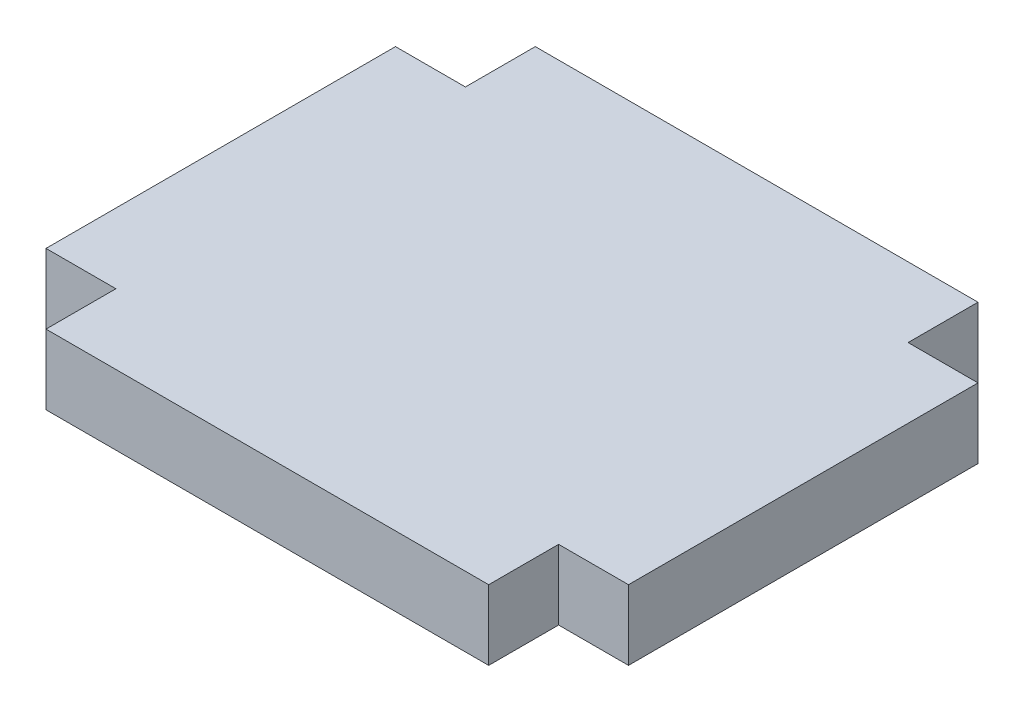
ISO-10303-21;
HEADER;
FILE_DESCRIPTION(('STEP AP214'),'2;1');
FILE_NAME('part.step','',(''),(''),'','','');
FILE_SCHEMA(('AUTOMOTIVE_DESIGN { 1 0 10303 214 1 1 1 1 }'));
ENDSEC;
DATA;
#1=APPLICATION_CONTEXT('core data for automotive mechanical design processes');
#2=APPLICATION_PROTOCOL_DEFINITION('international standard','automotive_design',2000,#1);
#3=PRODUCT_CONTEXT('',#1,'mechanical');
#4=PRODUCT('Part','Part','',(#3));
#5=PRODUCT_RELATED_PRODUCT_CATEGORY('part','',(#4));
#6=PRODUCT_DEFINITION_FORMATION('','',#4);
#7=PRODUCT_DEFINITION_CONTEXT('part definition',#1,'design');
#8=PRODUCT_DEFINITION('design','',#6,#7);
#9=PRODUCT_DEFINITION_SHAPE('','',#8);
#10=(LENGTH_UNIT() NAMED_UNIT(*) SI_UNIT(.MILLI.,.METRE.));
#11=(NAMED_UNIT(*) PLANE_ANGLE_UNIT() SI_UNIT($,.RADIAN.));
#12=(NAMED_UNIT(*) SI_UNIT($,.STERADIAN.) SOLID_ANGLE_UNIT());
#13=UNCERTAINTY_MEASURE_WITH_UNIT(LENGTH_MEASURE(1.E-05),#10,'distance_accuracy_value','');
#14=(GEOMETRIC_REPRESENTATION_CONTEXT(3) GLOBAL_UNCERTAINTY_ASSIGNED_CONTEXT((#13)) GLOBAL_UNIT_ASSIGNED_CONTEXT((#10,
#11,#12)) REPRESENTATION_CONTEXT('',''));
#15=CARTESIAN_POINT('',(0.,0.,0.));
#16=DIRECTION('',(0.,0.,1.));
#17=DIRECTION('',(1.,0.,0.));
#18=AXIS2_PLACEMENT_3D('',#15,#16,#17);
#19=CARTESIAN_POINT('',(-9.5,1.5,-7.50000000000001));
#20=DIRECTION('',(1.,0.,0.));
#21=DIRECTION('',(0.,0.,-1.));
#22=AXIS2_PLACEMENT_3D('',#19,#20,#21);
#23=PLANE('',#22);
#24=DIRECTION('',(0.,0.,1.));
#25=VECTOR('',#24,1.);
#26=CARTESIAN_POINT('',(-9.5,-1.5,-7.50000000000001));
#27=LINE('',#26,#25);
#28=CARTESIAN_POINT('',(-9.5,-1.5,-10.5));
#29=VERTEX_POINT('',#28);
#30=CARTESIAN_POINT('',(-9.5,-1.5,-7.50000000000001));
#31=VERTEX_POINT('',#30);
#32=EDGE_CURVE('E159',#29,#31,#27,.T.);
#33=ORIENTED_EDGE('',*,*,#32,.T.);
#34=DIRECTION('',(0.,-1.,0.));
#35=VECTOR('',#34,1.);
#36=CARTESIAN_POINT('',(-9.5,1.5,-7.50000000000001));
#37=LINE('',#36,#35);
#38=CARTESIAN_POINT('',(-9.5,1.5,-7.50000000000001));
#39=VERTEX_POINT('',#38);
#40=EDGE_CURVE('E11',#39,#31,#37,.T.);
#41=ORIENTED_EDGE('',*,*,#40,.F.);
#42=DIRECTION('',(0.,0.,1.));
#43=VECTOR('',#42,1.);
#44=CARTESIAN_POINT('',(-9.5,1.5,-7.50000000000001));
#45=LINE('',#44,#43);
#46=CARTESIAN_POINT('',(-9.5,1.5,-10.5));
#47=VERTEX_POINT('',#46);
#48=EDGE_CURVE('E181',#47,#39,#45,.T.);
#49=ORIENTED_EDGE('',*,*,#48,.F.);
#50=DIRECTION('',(0.,-1.,0.));
#51=VECTOR('',#50,1.);
#52=CARTESIAN_POINT('',(-9.5,1.5,-10.5));
#53=LINE('',#52,#51);
#54=EDGE_CURVE('E155',#47,#29,#53,.T.);
#55=ORIENTED_EDGE('',*,*,#54,.T.);
#56=EDGE_LOOP('',(#33,#41,#49,#55));
#57=FACE_BOUND('',#56,.T.);
#58=ADVANCED_FACE('F39',(#57),#23,.F.);
#59=CARTESIAN_POINT('',(-12.5,1.5,-7.5));
#60=DIRECTION('',(0.,0.,1.));
#61=DIRECTION('',(1.,0.,0.));
#62=AXIS2_PLACEMENT_3D('',#59,#60,#61);
#63=PLANE('',#62);
#64=DIRECTION('',(-1.,0.,0.));
#65=VECTOR('',#64,1.);
#66=CARTESIAN_POINT('',(-12.5,-1.5,-7.5));
#67=LINE('',#66,#65);
#68=CARTESIAN_POINT('',(-12.5,-1.5,-7.5));
#69=VERTEX_POINT('',#68);
#70=EDGE_CURVE('E162',#31,#69,#67,.T.);
#71=ORIENTED_EDGE('',*,*,#70,.T.);
#72=DIRECTION('',(0.,-1.,0.));
#73=VECTOR('',#72,1.);
#74=CARTESIAN_POINT('',(-12.5,1.5,-7.5));
#75=LINE('',#74,#73);
#76=CARTESIAN_POINT('',(-12.5,1.5,-7.5));
#77=VERTEX_POINT('',#76);
#78=EDGE_CURVE('E47',#77,#69,#75,.T.);
#79=ORIENTED_EDGE('',*,*,#78,.F.);
#80=DIRECTION('',(-1.,0.,0.));
#81=VECTOR('',#80,1.);
#82=CARTESIAN_POINT('',(-12.5,1.5,-7.5));
#83=LINE('',#82,#81);
#84=EDGE_CURVE('E110',#39,#77,#83,.T.);
#85=ORIENTED_EDGE('',*,*,#84,.F.);
#86=ORIENTED_EDGE('',*,*,#40,.T.);
#87=EDGE_LOOP('',(#71,#79,#85,#86));
#88=FACE_BOUND('',#87,.T.);
#89=ADVANCED_FACE('F259',(#88),#63,.F.);
#90=CARTESIAN_POINT('',(-12.5,1.5,7.5));
#91=DIRECTION('',(1.,0.,0.));
#92=DIRECTION('',(0.,0.,-1.));
#93=AXIS2_PLACEMENT_3D('',#90,#91,#92);
#94=PLANE('',#93);
#95=DIRECTION('',(0.,0.,1.));
#96=VECTOR('',#95,1.);
#97=CARTESIAN_POINT('',(-12.5,-1.5,7.5));
#98=LINE('',#97,#96);
#99=CARTESIAN_POINT('',(-12.5,-1.5,7.5));
#100=VERTEX_POINT('',#99);
#101=EDGE_CURVE('E164',#69,#100,#98,.T.);
#102=ORIENTED_EDGE('',*,*,#101,.T.);
#103=DIRECTION('',(0.,-1.,0.));
#104=VECTOR('',#103,1.);
#105=CARTESIAN_POINT('',(-12.5,1.5,7.5));
#106=LINE('',#105,#104);
#107=CARTESIAN_POINT('',(-12.5,1.5,7.5));
#108=VERTEX_POINT('',#107);
#109=EDGE_CURVE('E200',#108,#100,#106,.T.);
#110=ORIENTED_EDGE('',*,*,#109,.F.);
#111=DIRECTION('',(0.,0.,1.));
#112=VECTOR('',#111,1.);
#113=CARTESIAN_POINT('',(-12.5,1.5,7.5));
#114=LINE('',#113,#112);
#115=EDGE_CURVE('E208',#77,#108,#114,.T.);
#116=ORIENTED_EDGE('',*,*,#115,.F.);
#117=ORIENTED_EDGE('',*,*,#78,.T.);
#118=EDGE_LOOP('',(#102,#110,#116,#117));
#119=FACE_BOUND('',#118,.T.);
#120=ADVANCED_FACE('F206',(#119),#94,.F.);
#121=CARTESIAN_POINT('',(-9.5,1.5,7.50000000000001));
#122=DIRECTION('',(0.,0.,-1.));
#123=DIRECTION('',(-1.,0.,0.));
#124=AXIS2_PLACEMENT_3D('',#121,#122,#123);
#125=PLANE('',#124);
#126=DIRECTION('',(1.,0.,0.));
#127=VECTOR('',#126,1.);
#128=CARTESIAN_POINT('',(-9.5,-1.5,7.50000000000001));
#129=LINE('',#128,#127);
#130=CARTESIAN_POINT('',(-9.5,-1.5,7.50000000000001));
#131=VERTEX_POINT('',#130);
#132=EDGE_CURVE('E166',#100,#131,#129,.T.);
#133=ORIENTED_EDGE('',*,*,#132,.T.);
#134=DIRECTION('',(0.,-1.,0.));
#135=VECTOR('',#134,1.);
#136=CARTESIAN_POINT('',(-9.5,1.5,7.50000000000001));
#137=LINE('',#136,#135);
#138=CARTESIAN_POINT('',(-9.5,1.5,7.50000000000001));
#139=VERTEX_POINT('',#138);
#140=EDGE_CURVE('E197',#139,#131,#137,.T.);
#141=ORIENTED_EDGE('',*,*,#140,.F.);
#142=DIRECTION('',(1.,0.,0.));
#143=VECTOR('',#142,1.);
#144=CARTESIAN_POINT('',(-9.5,1.5,7.50000000000001));
#145=LINE('',#144,#143);
#146=EDGE_CURVE('E226',#108,#139,#145,.T.);
#147=ORIENTED_EDGE('',*,*,#146,.F.);
#148=ORIENTED_EDGE('',*,*,#109,.T.);
#149=EDGE_LOOP('',(#133,#141,#147,#148));
#150=FACE_BOUND('',#149,.T.);
#151=ADVANCED_FACE('F217',(#150),#125,.F.);
#152=CARTESIAN_POINT('',(-9.5,1.5,10.5));
#153=DIRECTION('',(1.,0.,0.));
#154=DIRECTION('',(0.,0.,-1.));
#155=AXIS2_PLACEMENT_3D('',#152,#153,#154);
#156=PLANE('',#155);
#157=DIRECTION('',(0.,0.,1.));
#158=VECTOR('',#157,1.);
#159=CARTESIAN_POINT('',(-9.5,-1.5,10.5));
#160=LINE('',#159,#158);
#161=CARTESIAN_POINT('',(-9.5,-1.5,10.5));
#162=VERTEX_POINT('',#161);
#163=EDGE_CURVE('E168',#131,#162,#160,.T.);
#164=ORIENTED_EDGE('',*,*,#163,.T.);
#165=DIRECTION('',(0.,-1.,0.));
#166=VECTOR('',#165,1.);
#167=CARTESIAN_POINT('',(-9.5,1.5,10.5));
#168=LINE('',#167,#166);
#169=CARTESIAN_POINT('',(-9.5,1.5,10.5));
#170=VERTEX_POINT('',#169);
#171=EDGE_CURVE('E194',#170,#162,#168,.T.);
#172=ORIENTED_EDGE('',*,*,#171,.F.);
#173=DIRECTION('',(0.,0.,1.));
#174=VECTOR('',#173,1.);
#175=CARTESIAN_POINT('',(-9.5,1.5,10.5));
#176=LINE('',#175,#174);
#177=EDGE_CURVE('E223',#139,#170,#176,.T.);
#178=ORIENTED_EDGE('',*,*,#177,.F.);
#179=ORIENTED_EDGE('',*,*,#140,.T.);
#180=EDGE_LOOP('',(#164,#172,#178,#179));
#181=FACE_BOUND('',#180,.T.);
#182=ADVANCED_FACE('F221',(#181),#156,.F.);
#183=CARTESIAN_POINT('',(9.5,1.5,10.5));
#184=DIRECTION('',(0.,0.,-1.));
#185=DIRECTION('',(-1.,0.,0.));
#186=AXIS2_PLACEMENT_3D('',#183,#184,#185);
#187=PLANE('',#186);
#188=DIRECTION('',(1.,0.,0.));
#189=VECTOR('',#188,1.);
#190=CARTESIAN_POINT('',(9.5,-1.5,10.5));
#191=LINE('',#190,#189);
#192=CARTESIAN_POINT('',(9.5,-1.5,10.5));
#193=VERTEX_POINT('',#192);
#194=EDGE_CURVE('E170',#162,#193,#191,.T.);
#195=ORIENTED_EDGE('',*,*,#194,.T.);
#196=DIRECTION('',(0.,-1.,0.));
#197=VECTOR('',#196,1.);
#198=CARTESIAN_POINT('',(9.5,1.5,10.5));
#199=LINE('',#198,#197);
#200=CARTESIAN_POINT('',(9.5,1.5,10.5));
#201=VERTEX_POINT('',#200);
#202=EDGE_CURVE('E191',#201,#193,#199,.T.);
#203=ORIENTED_EDGE('',*,*,#202,.F.);
#204=DIRECTION('',(1.,0.,0.));
#205=VECTOR('',#204,1.);
#206=CARTESIAN_POINT('',(9.5,1.5,10.5));
#207=LINE('',#206,#205);
#208=EDGE_CURVE('E225',#170,#201,#207,.T.);
#209=ORIENTED_EDGE('',*,*,#208,.F.);
#210=ORIENTED_EDGE('',*,*,#171,.T.);
#211=EDGE_LOOP('',(#195,#203,#209,#210));
#212=FACE_BOUND('',#211,.T.);
#213=ADVANCED_FACE('F272',(#212),#187,.F.);
#214=CARTESIAN_POINT('',(9.5,1.5,7.50000000000001));
#215=DIRECTION('',(-1.,0.,0.));
#216=DIRECTION('',(0.,0.,1.));
#217=AXIS2_PLACEMENT_3D('',#214,#215,#216);
#218=PLANE('',#217);
#219=DIRECTION('',(0.,0.,-1.));
#220=VECTOR('',#219,1.);
#221=CARTESIAN_POINT('',(9.5,-1.5,7.50000000000001));
#222=LINE('',#221,#220);
#223=CARTESIAN_POINT('',(9.5,-1.5,7.50000000000001));
#224=VERTEX_POINT('',#223);
#225=EDGE_CURVE('E172',#193,#224,#222,.T.);
#226=ORIENTED_EDGE('',*,*,#225,.T.);
#227=DIRECTION('',(0.,-1.,0.));
#228=VECTOR('',#227,1.);
#229=CARTESIAN_POINT('',(9.5,1.5,7.50000000000001));
#230=LINE('',#229,#228);
#231=CARTESIAN_POINT('',(9.5,1.5,7.50000000000001));
#232=VERTEX_POINT('',#231);
#233=EDGE_CURVE('E188',#232,#224,#230,.T.);
#234=ORIENTED_EDGE('',*,*,#233,.F.);
#235=DIRECTION('',(0.,0.,-1.));
#236=VECTOR('',#235,1.);
#237=CARTESIAN_POINT('',(9.5,1.5,7.50000000000001));
#238=LINE('',#237,#236);
#239=EDGE_CURVE('E228',#201,#232,#238,.T.);
#240=ORIENTED_EDGE('',*,*,#239,.F.);
#241=ORIENTED_EDGE('',*,*,#202,.T.);
#242=EDGE_LOOP('',(#226,#234,#240,#241));
#243=FACE_BOUND('',#242,.T.);
#244=ADVANCED_FACE('F275',(#243),#218,.F.);
#245=CARTESIAN_POINT('',(12.5,1.5,7.5));
#246=DIRECTION('',(0.,0.,-1.));
#247=DIRECTION('',(-1.,0.,0.));
#248=AXIS2_PLACEMENT_3D('',#245,#246,#247);
#249=PLANE('',#248);
#250=DIRECTION('',(1.,0.,0.));
#251=VECTOR('',#250,1.);
#252=CARTESIAN_POINT('',(12.5,-1.5,7.5));
#253=LINE('',#252,#251);
#254=CARTESIAN_POINT('',(12.5,-1.5,7.5));
#255=VERTEX_POINT('',#254);
#256=EDGE_CURVE('E174',#224,#255,#253,.T.);
#257=ORIENTED_EDGE('',*,*,#256,.T.);
#258=DIRECTION('',(0.,-1.,0.));
#259=VECTOR('',#258,1.);
#260=CARTESIAN_POINT('',(12.5,1.5,7.5));
#261=LINE('',#260,#259);
#262=CARTESIAN_POINT('',(12.5,1.5,7.5));
#263=VERTEX_POINT('',#262);
#264=EDGE_CURVE('E185',#263,#255,#261,.T.);
#265=ORIENTED_EDGE('',*,*,#264,.F.);
#266=DIRECTION('',(1.,0.,0.));
#267=VECTOR('',#266,1.);
#268=CARTESIAN_POINT('',(12.5,1.5,7.5));
#269=LINE('',#268,#267);
#270=EDGE_CURVE('E234',#232,#263,#269,.T.);
#271=ORIENTED_EDGE('',*,*,#270,.F.);
#272=ORIENTED_EDGE('',*,*,#233,.T.);
#273=EDGE_LOOP('',(#257,#265,#271,#272));
#274=FACE_BOUND('',#273,.T.);
#275=ADVANCED_FACE('F240',(#274),#249,.F.);
#276=CARTESIAN_POINT('',(12.5,1.5,-7.5));
#277=DIRECTION('',(-1.,0.,0.));
#278=DIRECTION('',(0.,0.,1.));
#279=AXIS2_PLACEMENT_3D('',#276,#277,#278);
#280=PLANE('',#279);
#281=DIRECTION('',(0.,0.,-1.));
#282=VECTOR('',#281,1.);
#283=CARTESIAN_POINT('',(12.5,-1.5,-7.5));
#284=LINE('',#283,#282);
#285=CARTESIAN_POINT('',(12.5,-1.5,-7.5));
#286=VERTEX_POINT('',#285);
#287=EDGE_CURVE('E176',#255,#286,#284,.T.);
#288=ORIENTED_EDGE('',*,*,#287,.T.);
#289=DIRECTION('',(0.,-1.,0.));
#290=VECTOR('',#289,1.);
#291=CARTESIAN_POINT('',(12.5,1.5,-7.5));
#292=LINE('',#291,#290);
#293=CARTESIAN_POINT('',(12.5,1.5,-7.5));
#294=VERTEX_POINT('',#293);
#295=EDGE_CURVE('E150',#294,#286,#292,.T.);
#296=ORIENTED_EDGE('',*,*,#295,.F.);
#297=DIRECTION('',(0.,0.,-1.));
#298=VECTOR('',#297,1.);
#299=CARTESIAN_POINT('',(12.5,1.5,-7.5));
#300=LINE('',#299,#298);
#301=EDGE_CURVE('E141',#263,#294,#300,.T.);
#302=ORIENTED_EDGE('',*,*,#301,.F.);
#303=ORIENTED_EDGE('',*,*,#264,.T.);
#304=EDGE_LOOP('',(#288,#296,#302,#303));
#305=FACE_BOUND('',#304,.T.);
#306=ADVANCED_FACE('F244',(#305),#280,.F.);
#307=CARTESIAN_POINT('',(9.5,1.5,-7.5));
#308=DIRECTION('',(0.,0.,1.));
#309=DIRECTION('',(1.,0.,0.));
#310=AXIS2_PLACEMENT_3D('',#307,#308,#309);
#311=PLANE('',#310);
#312=DIRECTION('',(-1.,0.,0.));
#313=VECTOR('',#312,1.);
#314=CARTESIAN_POINT('',(9.5,-1.5,-7.5));
#315=LINE('',#314,#313);
#316=CARTESIAN_POINT('',(9.5,-1.5,-7.5));
#317=VERTEX_POINT('',#316);
#318=EDGE_CURVE('E149',#286,#317,#315,.T.);
#319=ORIENTED_EDGE('',*,*,#318,.T.);
#320=DIRECTION('',(0.,-1.,0.));
#321=VECTOR('',#320,1.);
#322=CARTESIAN_POINT('',(9.5,1.5,-7.5));
#323=LINE('',#322,#321);
#324=CARTESIAN_POINT('',(9.5,1.5,-7.5));
#325=VERTEX_POINT('',#324);
#326=EDGE_CURVE('E146',#325,#317,#323,.T.);
#327=ORIENTED_EDGE('',*,*,#326,.F.);
#328=DIRECTION('',(-1.,0.,0.));
#329=VECTOR('',#328,1.);
#330=CARTESIAN_POINT('',(9.5,1.5,-7.5));
#331=LINE('',#330,#329);
#332=EDGE_CURVE('E135',#294,#325,#331,.T.);
#333=ORIENTED_EDGE('',*,*,#332,.F.);
#334=ORIENTED_EDGE('',*,*,#295,.T.);
#335=EDGE_LOOP('',(#319,#327,#333,#334));
#336=FACE_BOUND('',#335,.T.);
#337=ADVANCED_FACE('F147',(#336),#311,.F.);
#338=CARTESIAN_POINT('',(9.5,1.5,-10.5));
#339=DIRECTION('',(-1.,0.,0.));
#340=DIRECTION('',(0.,0.,1.));
#341=AXIS2_PLACEMENT_3D('',#338,#339,#340);
#342=PLANE('',#341);
#343=DIRECTION('',(0.,0.,-1.));
#344=VECTOR('',#343,1.);
#345=CARTESIAN_POINT('',(9.5,-1.5,-10.5));
#346=LINE('',#345,#344);
#347=CARTESIAN_POINT('',(9.5,-1.5,-10.5));
#348=VERTEX_POINT('',#347);
#349=EDGE_CURVE('E96',#317,#348,#346,.T.);
#350=ORIENTED_EDGE('',*,*,#349,.T.);
#351=DIRECTION('',(0.,-1.,0.));
#352=VECTOR('',#351,1.);
#353=CARTESIAN_POINT('',(9.5,1.5,-10.5));
#354=LINE('',#353,#352);
#355=CARTESIAN_POINT('',(9.5,1.5,-10.5));
#356=VERTEX_POINT('',#355);
#357=EDGE_CURVE('E151',#356,#348,#354,.T.);
#358=ORIENTED_EDGE('',*,*,#357,.F.);
#359=DIRECTION('',(0.,0.,-1.));
#360=VECTOR('',#359,1.);
#361=CARTESIAN_POINT('',(9.5,1.5,-10.5));
#362=LINE('',#361,#360);
#363=EDGE_CURVE('E139',#325,#356,#362,.T.);
#364=ORIENTED_EDGE('',*,*,#363,.F.);
#365=ORIENTED_EDGE('',*,*,#326,.T.);
#366=EDGE_LOOP('',(#350,#358,#364,#365));
#367=FACE_BOUND('',#366,.T.);
#368=ADVANCED_FACE('F153',(#367),#342,.F.);
#369=CARTESIAN_POINT('',(-9.5,1.5,-10.5));
#370=DIRECTION('',(0.,0.,1.));
#371=DIRECTION('',(1.,0.,0.));
#372=AXIS2_PLACEMENT_3D('',#369,#370,#371);
#373=PLANE('',#372);
#374=DIRECTION('',(-1.,0.,0.));
#375=VECTOR('',#374,1.);
#376=CARTESIAN_POINT('',(-9.5,-1.5,-10.5));
#377=LINE('',#376,#375);
#378=EDGE_CURVE('E102',#348,#29,#377,.T.);
#379=ORIENTED_EDGE('',*,*,#378,.T.);
#380=ORIENTED_EDGE('',*,*,#54,.F.);
#381=DIRECTION('',(-1.,0.,0.));
#382=VECTOR('',#381,1.);
#383=CARTESIAN_POINT('',(-9.5,1.5,-10.5));
#384=LINE('',#383,#382);
#385=EDGE_CURVE('E55',#356,#47,#384,.T.);
#386=ORIENTED_EDGE('',*,*,#385,.F.);
#387=ORIENTED_EDGE('',*,*,#357,.T.);
#388=EDGE_LOOP('',(#379,#380,#386,#387));
#389=FACE_BOUND('',#388,.T.);
#390=ADVANCED_FACE('F248',(#389),#373,.F.);
#391=CARTESIAN_POINT('',(0.,1.5,0.));
#392=DIRECTION('',(0.,-1.,0.));
#393=DIRECTION('',(0.,0.,-1.));
#394=AXIS2_PLACEMENT_3D('',#391,#392,#393);
#395=PLANE('',#394);
#396=ORIENTED_EDGE('',*,*,#48,.T.);
#397=ORIENTED_EDGE('',*,*,#84,.T.);
#398=ORIENTED_EDGE('',*,*,#115,.T.);
#399=ORIENTED_EDGE('',*,*,#146,.T.);
#400=ORIENTED_EDGE('',*,*,#177,.T.);
#401=ORIENTED_EDGE('',*,*,#208,.T.);
#402=ORIENTED_EDGE('',*,*,#239,.T.);
#403=ORIENTED_EDGE('',*,*,#270,.T.);
#404=ORIENTED_EDGE('',*,*,#301,.T.);
#405=ORIENTED_EDGE('',*,*,#332,.T.);
#406=ORIENTED_EDGE('',*,*,#363,.T.);
#407=ORIENTED_EDGE('',*,*,#385,.T.);
#408=EDGE_LOOP('',(#396,#397,#398,#399,#400,#401,#402,#403,#404,#405,#406,#407));
#409=FACE_BOUND('',#408,.T.);
#410=ADVANCED_FACE('F137',(#409),#395,.F.);
#411=CARTESIAN_POINT('',(0.,-1.5,0.));
#412=DIRECTION('',(0.,-1.,0.));
#413=DIRECTION('',(0.,0.,-1.));
#414=AXIS2_PLACEMENT_3D('',#411,#412,#413);
#415=PLANE('',#414);
#416=ORIENTED_EDGE('',*,*,#32,.F.);
#417=ORIENTED_EDGE('',*,*,#378,.F.);
#418=ORIENTED_EDGE('',*,*,#349,.F.);
#419=ORIENTED_EDGE('',*,*,#318,.F.);
#420=ORIENTED_EDGE('',*,*,#287,.F.);
#421=ORIENTED_EDGE('',*,*,#256,.F.);
#422=ORIENTED_EDGE('',*,*,#225,.F.);
#423=ORIENTED_EDGE('',*,*,#194,.F.);
#424=ORIENTED_EDGE('',*,*,#163,.F.);
#425=ORIENTED_EDGE('',*,*,#132,.F.);
#426=ORIENTED_EDGE('',*,*,#101,.F.);
#427=ORIENTED_EDGE('',*,*,#70,.F.);
#428=EDGE_LOOP('',(#416,#417,#418,#419,#420,#421,#422,#423,#424,#425,#426,#427));
#429=FACE_BOUND('',#428,.T.);
#430=ADVANCED_FACE('F212',(#429),#415,.T.);
#431=CLOSED_SHELL('',(#58,#89,#120,#151,#182,#213,#244,#275,#306,#337,#368,#390,#410,#430));
#432=MANIFOLD_SOLID_BREP('B2',#431);
#433=ADVANCED_BREP_SHAPE_REPRESENTATION('',(#18,#432),#14);
#434=SHAPE_DEFINITION_REPRESENTATION(#9,#433);
ENDSEC;
END-ISO-10303-21;
